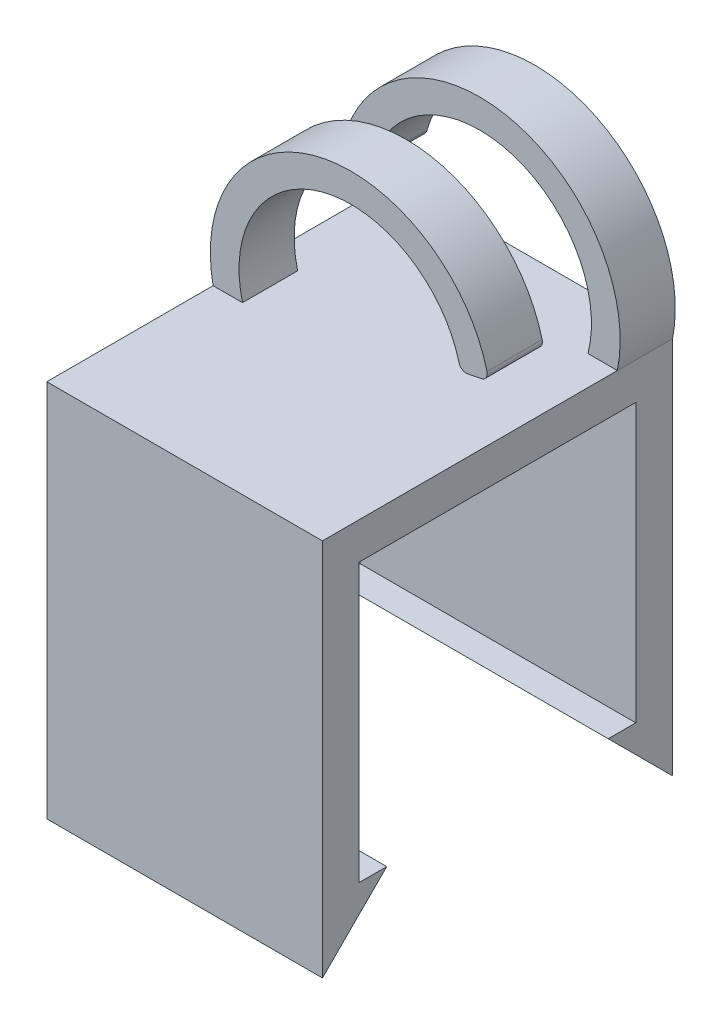
ISO-10303-21;
HEADER;
FILE_DESCRIPTION(('STEP AP214'),'2;1');
FILE_NAME('part.step','',(''),(''),'','','');
FILE_SCHEMA(('AUTOMOTIVE_DESIGN { 1 0 10303 214 1 1 1 1 }'));
ENDSEC;
DATA;
#1=APPLICATION_CONTEXT('core data for automotive mechanical design processes');
#2=APPLICATION_PROTOCOL_DEFINITION('international standard','automotive_design',2000,#1);
#3=PRODUCT_CONTEXT('',#1,'mechanical');
#4=PRODUCT('Part','Part','',(#3));
#5=PRODUCT_RELATED_PRODUCT_CATEGORY('part','',(#4));
#6=PRODUCT_DEFINITION_FORMATION('','',#4);
#7=PRODUCT_DEFINITION_CONTEXT('part definition',#1,'design');
#8=PRODUCT_DEFINITION('design','',#6,#7);
#9=PRODUCT_DEFINITION_SHAPE('','',#8);
#10=(LENGTH_UNIT() NAMED_UNIT(*) SI_UNIT(.MILLI.,.METRE.));
#11=(NAMED_UNIT(*) PLANE_ANGLE_UNIT() SI_UNIT($,.RADIAN.));
#12=(NAMED_UNIT(*) SI_UNIT($,.STERADIAN.) SOLID_ANGLE_UNIT());
#13=UNCERTAINTY_MEASURE_WITH_UNIT(LENGTH_MEASURE(1.E-05),#10,'distance_accuracy_value','');
#14=(GEOMETRIC_REPRESENTATION_CONTEXT(3) GLOBAL_UNCERTAINTY_ASSIGNED_CONTEXT((#13)) GLOBAL_UNIT_ASSIGNED_CONTEXT((#10,
#11,#12)) REPRESENTATION_CONTEXT('',''));
#15=CARTESIAN_POINT('',(0.,0.,0.));
#16=DIRECTION('',(0.,0.,1.));
#17=DIRECTION('',(1.,0.,0.));
#18=AXIS2_PLACEMENT_3D('',#15,#16,#17);
#19=CARTESIAN_POINT('',(0.,17.1,0.));
#20=DIRECTION('',(0.,1.,0.));
#21=DIRECTION('',(0.,0.,1.));
#22=AXIS2_PLACEMENT_3D('',#19,#20,#21);
#23=PLANE('',#22);
#24=DIRECTION('',(0.,0.,-1.));
#25=VECTOR('',#24,1.);
#26=CARTESIAN_POINT('',(-14.0296296296296,17.1,3.13518518518521));
#27=LINE('',#26,#25);
#28=CARTESIAN_POINT('',(-14.0296296296296,17.1,3.13518518518521));
#29=VERTEX_POINT('',#28);
#30=CARTESIAN_POINT('',(-14.0296296296296,17.1,0.135185185185208));
#31=VERTEX_POINT('',#30);
#32=EDGE_CURVE('E52',#29,#31,#27,.T.);
#33=ORIENTED_EDGE('',*,*,#32,.F.);
#34=DIRECTION('',(1.,0.,0.));
#35=VECTOR('',#34,1.);
#36=CARTESIAN_POINT('',(-15.6296296296296,17.1,3.13518518518521));
#37=LINE('',#36,#35);
#38=CARTESIAN_POINT('',(-15.6296296296296,17.1,3.1351851851852));
#39=VERTEX_POINT('',#38);
#40=EDGE_CURVE('E187',#39,#29,#37,.T.);
#41=ORIENTED_EDGE('',*,*,#40,.F.);
#42=DIRECTION('',(0.,0.,1.));
#43=VECTOR('',#42,1.);
#44=CARTESIAN_POINT('',(-15.6296296296296,17.1,-6.86481481481479));
#45=LINE('',#44,#43);
#46=CARTESIAN_POINT('',(-15.6296296296296,17.1,12.1851851851852));
#47=VERTEX_POINT('',#46);
#48=EDGE_CURVE('E324',#39,#47,#45,.T.);
#49=ORIENTED_EDGE('',*,*,#48,.T.);
#50=DIRECTION('',(1.,0.,0.));
#51=VECTOR('',#50,1.);
#52=CARTESIAN_POINT('',(-15.6296296296296,17.1,12.1851851851852));
#53=LINE('',#52,#51);
#54=CARTESIAN_POINT('',(-0.629629629629607,17.1,12.1851851851852));
#55=VERTEX_POINT('',#54);
#56=EDGE_CURVE('E323',#47,#55,#53,.T.);
#57=ORIENTED_EDGE('',*,*,#56,.T.);
#58=DIRECTION('',(0.,0.,-1.));
#59=VECTOR('',#58,1.);
#60=CARTESIAN_POINT('',(-0.629629629629609,17.1,-6.86481481481479));
#61=LINE('',#60,#59);
#62=CARTESIAN_POINT('',(-0.629629629629609,17.1,-3.86481481481479));
#63=VERTEX_POINT('',#62);
#64=EDGE_CURVE('E326',#55,#63,#61,.T.);
#65=ORIENTED_EDGE('',*,*,#64,.T.);
#66=DIRECTION('',(-1.,0.,0.));
#67=VECTOR('',#66,1.);
#68=CARTESIAN_POINT('',(-2.22962962962961,17.1,-3.86481481481479));
#69=LINE('',#68,#67);
#70=CARTESIAN_POINT('',(-2.22962962962961,17.1,-3.86481481481479));
#71=VERTEX_POINT('',#70);
#72=EDGE_CURVE('E236',#63,#71,#69,.T.);
#73=ORIENTED_EDGE('',*,*,#72,.T.);
#74=DIRECTION('',(0.,0.,-1.));
#75=VECTOR('',#74,1.);
#76=CARTESIAN_POINT('',(-2.22962962962961,17.1,-3.86481481481479));
#77=LINE('',#76,#75);
#78=CARTESIAN_POINT('',(-2.22962962962961,17.1,-6.86481481481479));
#79=VERTEX_POINT('',#78);
#80=EDGE_CURVE('E274',#71,#79,#77,.T.);
#81=ORIENTED_EDGE('',*,*,#80,.T.);
#82=DIRECTION('',(-1.,0.,0.));
#83=VECTOR('',#82,1.);
#84=CARTESIAN_POINT('',(-15.6296296296296,17.1,-6.86481481481479));
#85=LINE('',#84,#83);
#86=CARTESIAN_POINT('',(-15.6296296296296,17.1,-6.86481481481479));
#87=VERTEX_POINT('',#86);
#88=EDGE_CURVE('E329',#79,#87,#85,.T.);
#89=ORIENTED_EDGE('',*,*,#88,.T.);
#90=CARTESIAN_POINT('',(-15.6296296296296,17.1,0.135185185185208));
#91=VERTEX_POINT('',#90);
#92=EDGE_CURVE('E321',#87,#91,#45,.T.);
#93=ORIENTED_EDGE('',*,*,#92,.T.);
#94=DIRECTION('',(1.,0.,0.));
#95=VECTOR('',#94,1.);
#96=CARTESIAN_POINT('',(-15.6296296296296,17.1,0.135185185185208));
#97=LINE('',#96,#95);
#98=EDGE_CURVE('E57',#91,#31,#97,.T.);
#99=ORIENTED_EDGE('',*,*,#98,.T.);
#100=EDGE_LOOP('',(#33,#41,#49,#57,#65,#73,#81,#89,#93,#99));
#101=FACE_BOUND('',#100,.T.);
#102=ADVANCED_FACE('F37',(#101),#23,.T.);
#103=CARTESIAN_POINT('',(-15.6296296296296,15.1,0.));
#104=DIRECTION('',(1.,0.,0.));
#105=DIRECTION('',(0.,0.,-1.));
#106=AXIS2_PLACEMENT_3D('',#103,#104,#105);
#107=PLANE('',#106);
#108=DIRECTION('',(0.,-1.,0.));
#109=VECTOR('',#108,1.);
#110=CARTESIAN_POINT('',(-15.6296296296296,15.1,-6.86481481481479));
#111=LINE('',#110,#109);
#112=CARTESIAN_POINT('',(-15.6296296296296,-3.5,-6.86481481481479));
#113=VERTEX_POINT('',#112);
#114=EDGE_CURVE('E343',#87,#113,#111,.T.);
#115=ORIENTED_EDGE('',*,*,#114,.T.);
#116=DIRECTION('',(0.,0.707106781186547,0.707106781186547));
#117=VECTOR('',#116,1.);
#118=CARTESIAN_POINT('',(-15.6296296296296,0.,-3.36481481481479));
#119=LINE('',#118,#117);
#120=CARTESIAN_POINT('',(-15.6296296296296,0.,-3.36481481481479));
#121=VERTEX_POINT('',#120);
#122=EDGE_CURVE('E292',#113,#121,#119,.T.);
#123=ORIENTED_EDGE('',*,*,#122,.T.);
#124=DIRECTION('',(0.,0.,-1.));
#125=VECTOR('',#124,1.);
#126=CARTESIAN_POINT('',(-15.6296296296296,0.,-6.86481481481479));
#127=LINE('',#126,#125);
#128=CARTESIAN_POINT('',(-15.6296296296296,0.,-4.86481481481479));
#129=VERTEX_POINT('',#128);
#130=EDGE_CURVE('E299',#121,#129,#127,.T.);
#131=ORIENTED_EDGE('',*,*,#130,.T.);
#132=DIRECTION('',(0.,-1.,0.));
#133=VECTOR('',#132,1.);
#134=CARTESIAN_POINT('',(-15.6296296296296,15.1,-4.86481481481479));
#135=LINE('',#134,#133);
#136=CARTESIAN_POINT('',(-15.6296296296296,15.1,-4.86481481481479));
#137=VERTEX_POINT('',#136);
#138=EDGE_CURVE('E11',#137,#129,#135,.T.);
#139=ORIENTED_EDGE('',*,*,#138,.F.);
#140=DIRECTION('',(0.,0.,1.));
#141=VECTOR('',#140,1.);
#142=CARTESIAN_POINT('',(-15.6296296296296,15.1,-6.86481481481479));
#143=LINE('',#142,#141);
#144=CARTESIAN_POINT('',(-15.6296296296296,15.1,10.1851851851852));
#145=VERTEX_POINT('',#144);
#146=EDGE_CURVE('E320',#137,#145,#143,.T.);
#147=ORIENTED_EDGE('',*,*,#146,.T.);
#148=DIRECTION('',(0.,-1.,0.));
#149=VECTOR('',#148,1.);
#150=CARTESIAN_POINT('',(-15.6296296296296,15.1,10.1851851851852));
#151=LINE('',#150,#149);
#152=CARTESIAN_POINT('',(-15.6296296296296,0.,10.1851851851852));
#153=VERTEX_POINT('',#152);
#154=EDGE_CURVE('E317',#145,#153,#151,.T.);
#155=ORIENTED_EDGE('',*,*,#154,.T.);
#156=DIRECTION('',(0.,0.,-1.));
#157=VECTOR('',#156,1.);
#158=CARTESIAN_POINT('',(-15.6296296296296,0.,12.1851851851852));
#159=LINE('',#158,#157);
#160=CARTESIAN_POINT('',(-15.6296296296296,0.,8.68518518518521));
#161=VERTEX_POINT('',#160);
#162=EDGE_CURVE('E267',#153,#161,#159,.T.);
#163=ORIENTED_EDGE('',*,*,#162,.T.);
#164=DIRECTION('',(0.,-0.707106781186547,0.707106781186547));
#165=VECTOR('',#164,1.);
#166=CARTESIAN_POINT('',(-15.6296296296296,0.,8.68518518518521));
#167=LINE('',#166,#165);
#168=CARTESIAN_POINT('',(-15.6296296296296,-3.5,12.1851851851852));
#169=VERTEX_POINT('',#168);
#170=EDGE_CURVE('E282',#161,#169,#167,.T.);
#171=ORIENTED_EDGE('',*,*,#170,.T.);
#172=DIRECTION('',(0.,-1.,0.));
#173=VECTOR('',#172,1.);
#174=CARTESIAN_POINT('',(-15.6296296296296,17.1,12.1851851851852));
#175=LINE('',#174,#173);
#176=EDGE_CURVE('E337',#47,#169,#175,.T.);
#177=ORIENTED_EDGE('',*,*,#176,.F.);
#178=ORIENTED_EDGE('',*,*,#48,.F.);
#179=DIRECTION('',(0.,0.,-1.));
#180=VECTOR('',#179,1.);
#181=CARTESIAN_POINT('',(-15.6296296296296,17.1,3.13518518518521));
#182=LINE('',#181,#180);
#183=EDGE_CURVE('E229',#39,#91,#182,.T.);
#184=ORIENTED_EDGE('',*,*,#183,.T.);
#185=ORIENTED_EDGE('',*,*,#92,.F.);
#186=EDGE_LOOP('',(#115,#123,#131,#139,#147,#155,#163,#171,#177,#178,#184,#185));
#187=FACE_BOUND('',#186,.T.);
#188=ADVANCED_FACE('F39',(#187),#107,.F.);
#189=CARTESIAN_POINT('',(0.,15.1,-4.86481481481479));
#190=DIRECTION('',(0.,0.,-1.));
#191=DIRECTION('',(-1.,0.,0.));
#192=AXIS2_PLACEMENT_3D('',#189,#190,#191);
#193=PLANE('',#192);
#194=DIRECTION('',(1.,0.,0.));
#195=VECTOR('',#194,1.);
#196=CARTESIAN_POINT('',(0.,0.,-4.86481481481479));
#197=LINE('',#196,#195);
#198=CARTESIAN_POINT('',(-0.629629629629615,0.,-4.86481481481479));
#199=VERTEX_POINT('',#198);
#200=EDGE_CURVE('E339',#129,#199,#197,.T.);
#201=ORIENTED_EDGE('',*,*,#200,.T.);
#202=DIRECTION('',(0.,-1.,0.));
#203=VECTOR('',#202,1.);
#204=CARTESIAN_POINT('',(-0.629629629629614,15.1,-4.86481481481479));
#205=LINE('',#204,#203);
#206=CARTESIAN_POINT('',(-0.629629629629609,15.1,-4.86481481481479));
#207=VERTEX_POINT('',#206);
#208=EDGE_CURVE('E45',#207,#199,#205,.T.);
#209=ORIENTED_EDGE('',*,*,#208,.F.);
#210=DIRECTION('',(1.,0.,0.));
#211=VECTOR('',#210,1.);
#212=CARTESIAN_POINT('',(0.,15.1,-4.86481481481479));
#213=LINE('',#212,#211);
#214=EDGE_CURVE('E340',#137,#207,#213,.T.);
#215=ORIENTED_EDGE('',*,*,#214,.F.);
#216=ORIENTED_EDGE('',*,*,#138,.T.);
#217=EDGE_LOOP('',(#201,#209,#215,#216));
#218=FACE_BOUND('',#217,.T.);
#219=ADVANCED_FACE('F357',(#218),#193,.F.);
#220=CARTESIAN_POINT('',(-0.629629629629612,15.1,0.));
#221=DIRECTION('',(1.,0.,0.));
#222=DIRECTION('',(0.,0.,-1.));
#223=AXIS2_PLACEMENT_3D('',#220,#221,#222);
#224=PLANE('',#223);
#225=ORIENTED_EDGE('',*,*,#208,.T.);
#226=DIRECTION('',(0.,0.,-1.));
#227=VECTOR('',#226,1.);
#228=CARTESIAN_POINT('',(-0.629629629629615,0.,-6.86481481481479));
#229=LINE('',#228,#227);
#230=CARTESIAN_POINT('',(-0.629629629629615,0.,-3.36481481481479));
#231=VERTEX_POINT('',#230);
#232=EDGE_CURVE('E298',#231,#199,#229,.T.);
#233=ORIENTED_EDGE('',*,*,#232,.F.);
#234=DIRECTION('',(0.,0.707106781186547,0.707106781186547));
#235=VECTOR('',#234,1.);
#236=CARTESIAN_POINT('',(-0.629629629629615,0.,-3.36481481481479));
#237=LINE('',#236,#235);
#238=CARTESIAN_POINT('',(-0.629629629629615,-3.5,-6.86481481481479));
#239=VERTEX_POINT('',#238);
#240=EDGE_CURVE('E295',#239,#231,#237,.T.);
#241=ORIENTED_EDGE('',*,*,#240,.F.);
#242=DIRECTION('',(0.,-1.,0.));
#243=VECTOR('',#242,1.);
#244=CARTESIAN_POINT('',(-0.629629629629615,15.1,-6.86481481481479));
#245=LINE('',#244,#243);
#246=CARTESIAN_POINT('',(-0.629629629629609,17.1,-6.86481481481479));
#247=VERTEX_POINT('',#246);
#248=EDGE_CURVE('E347',#247,#239,#245,.T.);
#249=ORIENTED_EDGE('',*,*,#248,.F.);
#250=DIRECTION('',(0.,0.,-1.));
#251=VECTOR('',#250,1.);
#252=CARTESIAN_POINT('',(-0.629629629629609,17.1,-3.86481481481479));
#253=LINE('',#252,#251);
#254=EDGE_CURVE('E251',#63,#247,#253,.T.);
#255=ORIENTED_EDGE('',*,*,#254,.F.);
#256=ORIENTED_EDGE('',*,*,#64,.F.);
#257=DIRECTION('',(0.,-1.,0.));
#258=VECTOR('',#257,1.);
#259=CARTESIAN_POINT('',(-0.629629629629607,17.1,12.1851851851852));
#260=LINE('',#259,#258);
#261=CARTESIAN_POINT('',(-0.629629629629615,-3.5,12.1851851851852));
#262=VERTEX_POINT('',#261);
#263=EDGE_CURVE('E331',#55,#262,#260,.T.);
#264=ORIENTED_EDGE('',*,*,#263,.T.);
#265=DIRECTION('',(0.,-0.707106781186547,0.707106781186547));
#266=VECTOR('',#265,1.);
#267=CARTESIAN_POINT('',(-0.629629629629615,0.,8.68518518518521));
#268=LINE('',#267,#266);
#269=CARTESIAN_POINT('',(-0.629629629629615,0.,8.68518518518521));
#270=VERTEX_POINT('',#269);
#271=EDGE_CURVE('E281',#270,#262,#268,.T.);
#272=ORIENTED_EDGE('',*,*,#271,.F.);
#273=DIRECTION('',(0.,0.,-1.));
#274=VECTOR('',#273,1.);
#275=CARTESIAN_POINT('',(-0.629629629629615,0.,12.1851851851852));
#276=LINE('',#275,#274);
#277=CARTESIAN_POINT('',(-0.629629629629615,0.,10.1851851851852));
#278=VERTEX_POINT('',#277);
#279=EDGE_CURVE('E279',#278,#270,#276,.T.);
#280=ORIENTED_EDGE('',*,*,#279,.F.);
#281=DIRECTION('',(0.,-1.,0.));
#282=VECTOR('',#281,1.);
#283=CARTESIAN_POINT('',(-0.629629629629608,15.1,10.1851851851852));
#284=LINE('',#283,#282);
#285=CARTESIAN_POINT('',(-0.629629629629608,15.1,10.1851851851852));
#286=VERTEX_POINT('',#285);
#287=EDGE_CURVE('E313',#286,#278,#284,.T.);
#288=ORIENTED_EDGE('',*,*,#287,.F.);
#289=DIRECTION('',(0.,0.,-1.));
#290=VECTOR('',#289,1.);
#291=CARTESIAN_POINT('',(-0.629629629629609,15.1,-6.86481481481479));
#292=LINE('',#291,#290);
#293=EDGE_CURVE('E334',#286,#207,#292,.T.);
#294=ORIENTED_EDGE('',*,*,#293,.T.);
#295=EDGE_LOOP('',(#225,#233,#241,#249,#255,#256,#264,#272,#280,#288,#294));
#296=FACE_BOUND('',#295,.T.);
#297=ADVANCED_FACE('F352',(#296),#224,.T.);
#298=CARTESIAN_POINT('',(0.,15.1,-6.86481481481479));
#299=DIRECTION('',(0.,0.,-1.));
#300=DIRECTION('',(-1.,0.,0.));
#301=AXIS2_PLACEMENT_3D('',#298,#299,#300);
#302=PLANE('',#301);
#303=ORIENTED_EDGE('',*,*,#248,.T.);
#304=DIRECTION('',(-1.,0.,0.));
#305=VECTOR('',#304,1.);
#306=CARTESIAN_POINT('',(-0.629629629629615,-3.5,-6.86481481481479));
#307=LINE('',#306,#305);
#308=EDGE_CURVE('E301',#239,#113,#307,.T.);
#309=ORIENTED_EDGE('',*,*,#308,.T.);
#310=ORIENTED_EDGE('',*,*,#114,.F.);
#311=ORIENTED_EDGE('',*,*,#88,.F.);
#312=CARTESIAN_POINT('',(-8.12962962962961,18.6,-6.86481481481479));
#313=DIRECTION('',(0.,0.,1.));
#314=DIRECTION('',(1.,0.,0.));
#315=AXIS2_PLACEMENT_3D('',#312,#313,#314);
#316=CIRCLE('',#315,6.08769250208977);
#317=CARTESIAN_POINT('',(-13.9912687766734,20.2435286763071,-6.86481481481479));
#318=VERTEX_POINT('',#317);
#319=EDGE_CURVE('E254',#79,#318,#316,.T.);
#320=ORIENTED_EDGE('',*,*,#319,.T.);
#321=CARTESIAN_POINT('',(-14.4727023531091,20.3785164960552,-6.86481481481479));
#322=DIRECTION('',(0.,0.,-1.));
#323=DIRECTION('',(-1.,0.,0.));
#324=AXIS2_PLACEMENT_3D('',#321,#322,#323);
#325=CIRCLE('',#324,0.499999999999997);
#326=CARTESIAN_POINT('',(-14.5707604206782,19.8882261582097,-6.86481481481479));
#327=VERTEX_POINT('',#326);
#328=EDGE_CURVE('E257',#318,#327,#325,.T.);
#329=ORIENTED_EDGE('',*,*,#328,.T.);
#330=DIRECTION('',(-0.980580675690921,0.196116135138179,0.));
#331=VECTOR('',#330,1.);
#332=CARTESIAN_POINT('',(-14.5707604206782,19.8882261582097,-6.86481481481479));
#333=LINE('',#332,#331);
#334=CARTESIAN_POINT('',(-15.1221717233405,19.9985084187422,-6.86481481481479));
#335=VERTEX_POINT('',#334);
#336=EDGE_CURVE('E260',#327,#335,#333,.T.);
#337=ORIENTED_EDGE('',*,*,#336,.T.);
#338=CARTESIAN_POINT('',(-15.0241136557714,20.4887987565876,-6.86481481481479));
#339=DIRECTION('',(0.,0.,-1.));
#340=DIRECTION('',(1.,0.,0.));
#341=AXIS2_PLACEMENT_3D('',#338,#339,#340);
#342=CIRCLE('',#341,0.499999999999997);
#343=CARTESIAN_POINT('',(-15.5063445990439,20.620909760484,-6.86481481481479));
#344=VERTEX_POINT('',#343);
#345=EDGE_CURVE('E237',#335,#344,#342,.T.);
#346=ORIENTED_EDGE('',*,*,#345,.T.);
#347=CARTESIAN_POINT('',(-8.12962962962961,18.6,-6.86481481481479));
#348=DIRECTION('',(0.,0.,-1.));
#349=DIRECTION('',(1.,0.,0.));
#350=AXIS2_PLACEMENT_3D('',#347,#348,#349);
#351=CIRCLE('',#350,7.64852927038918);
#352=EDGE_CURVE('E232',#344,#247,#351,.T.);
#353=ORIENTED_EDGE('',*,*,#352,.T.);
#354=EDGE_LOOP('',(#303,#309,#310,#311,#320,#329,#337,#346,#353));
#355=FACE_BOUND('',#354,.T.);
#356=ADVANCED_FACE('F372',(#355),#302,.T.);
#357=CARTESIAN_POINT('',(0.,15.1,0.));
#358=DIRECTION('',(0.,1.,0.));
#359=DIRECTION('',(0.,0.,1.));
#360=AXIS2_PLACEMENT_3D('',#357,#358,#359);
#361=PLANE('',#360);
#362=ORIENTED_EDGE('',*,*,#293,.F.);
#363=DIRECTION('',(1.,0.,0.));
#364=VECTOR('',#363,1.);
#365=CARTESIAN_POINT('',(0.,15.1,10.1851851851852));
#366=LINE('',#365,#364);
#367=EDGE_CURVE('E310',#145,#286,#366,.T.);
#368=ORIENTED_EDGE('',*,*,#367,.F.);
#369=ORIENTED_EDGE('',*,*,#146,.F.);
#370=ORIENTED_EDGE('',*,*,#214,.T.);
#371=EDGE_LOOP('',(#362,#368,#369,#370));
#372=FACE_BOUND('',#371,.T.);
#373=ADVANCED_FACE('F428',(#372),#361,.F.);
#374=CARTESIAN_POINT('',(-15.6296296296296,17.1,12.1851851851852));
#375=DIRECTION('',(0.,0.,-1.));
#376=DIRECTION('',(-1.,0.,0.));
#377=AXIS2_PLACEMENT_3D('',#374,#375,#376);
#378=PLANE('',#377);
#379=ORIENTED_EDGE('',*,*,#176,.T.);
#380=DIRECTION('',(-1.,0.,0.));
#381=VECTOR('',#380,1.);
#382=CARTESIAN_POINT('',(-0.629629629629615,-3.5,12.1851851851852));
#383=LINE('',#382,#381);
#384=EDGE_CURVE('E289',#262,#169,#383,.T.);
#385=ORIENTED_EDGE('',*,*,#384,.F.);
#386=ORIENTED_EDGE('',*,*,#263,.F.);
#387=ORIENTED_EDGE('',*,*,#56,.F.);
#388=EDGE_LOOP('',(#379,#385,#386,#387));
#389=FACE_BOUND('',#388,.T.);
#390=ADVANCED_FACE('F431',(#389),#378,.F.);
#391=CARTESIAN_POINT('',(0.,15.1,10.1851851851852));
#392=DIRECTION('',(0.,0.,-1.));
#393=DIRECTION('',(-1.,0.,0.));
#394=AXIS2_PLACEMENT_3D('',#391,#392,#393);
#395=PLANE('',#394);
#396=DIRECTION('',(1.,0.,0.));
#397=VECTOR('',#396,1.);
#398=CARTESIAN_POINT('',(0.,0.,10.1851851851852));
#399=LINE('',#398,#397);
#400=EDGE_CURVE('E307',#153,#278,#399,.T.);
#401=ORIENTED_EDGE('',*,*,#400,.F.);
#402=ORIENTED_EDGE('',*,*,#154,.F.);
#403=ORIENTED_EDGE('',*,*,#367,.T.);
#404=ORIENTED_EDGE('',*,*,#287,.T.);
#405=EDGE_LOOP('',(#401,#402,#403,#404));
#406=FACE_BOUND('',#405,.T.);
#407=ADVANCED_FACE('F426',(#406),#395,.T.);
#408=CARTESIAN_POINT('',(-0.629629629629615,0.,-6.86481481481479));
#409=DIRECTION('',(0.,1.,0.));
#410=DIRECTION('',(0.,0.,1.));
#411=AXIS2_PLACEMENT_3D('',#408,#409,#410);
#412=PLANE('',#411);
#413=ORIENTED_EDGE('',*,*,#200,.F.);
#414=ORIENTED_EDGE('',*,*,#130,.F.);
#415=DIRECTION('',(-1.,0.,0.));
#416=VECTOR('',#415,1.);
#417=CARTESIAN_POINT('',(-0.629629629629615,0.,-3.36481481481479));
#418=LINE('',#417,#416);
#419=EDGE_CURVE('E305',#231,#121,#418,.T.);
#420=ORIENTED_EDGE('',*,*,#419,.F.);
#421=ORIENTED_EDGE('',*,*,#232,.T.);
#422=EDGE_LOOP('',(#413,#414,#420,#421));
#423=FACE_BOUND('',#422,.T.);
#424=ADVANCED_FACE('F361',(#423),#412,.T.);
#425=CARTESIAN_POINT('',(-0.629629629629615,0.,-3.36481481481479));
#426=DIRECTION('',(0.,-0.707106781186548,0.707106781186548));
#427=DIRECTION('',(0.,-0.707106781186548,-0.707106781186548));
#428=AXIS2_PLACEMENT_3D('',#425,#426,#427);
#429=PLANE('',#428);
#430=ORIENTED_EDGE('',*,*,#122,.F.);
#431=ORIENTED_EDGE('',*,*,#308,.F.);
#432=ORIENTED_EDGE('',*,*,#240,.T.);
#433=ORIENTED_EDGE('',*,*,#419,.T.);
#434=EDGE_LOOP('',(#430,#431,#432,#433));
#435=FACE_BOUND('',#434,.T.);
#436=ADVANCED_FACE('F365',(#435),#429,.T.);
#437=CARTESIAN_POINT('',(-0.629629629629615,0.,8.68518518518521));
#438=DIRECTION('',(0.,-0.707106781186547,-0.707106781186547));
#439=DIRECTION('',(0.,0.707106781186548,-0.707106781186548));
#440=AXIS2_PLACEMENT_3D('',#437,#438,#439);
#441=PLANE('',#440);
#442=ORIENTED_EDGE('',*,*,#170,.F.);
#443=DIRECTION('',(-1.,0.,0.));
#444=VECTOR('',#443,1.);
#445=CARTESIAN_POINT('',(-0.629629629629615,0.,8.68518518518521));
#446=LINE('',#445,#444);
#447=EDGE_CURVE('E285',#270,#161,#446,.T.);
#448=ORIENTED_EDGE('',*,*,#447,.F.);
#449=ORIENTED_EDGE('',*,*,#271,.T.);
#450=ORIENTED_EDGE('',*,*,#384,.T.);
#451=EDGE_LOOP('',(#442,#448,#449,#450));
#452=FACE_BOUND('',#451,.T.);
#453=ADVANCED_FACE('F480',(#452),#441,.T.);
#454=CARTESIAN_POINT('',(-0.629629629629615,0.,12.1851851851852));
#455=DIRECTION('',(0.,1.,0.));
#456=DIRECTION('',(0.,0.,1.));
#457=AXIS2_PLACEMENT_3D('',#454,#455,#456);
#458=PLANE('',#457);
#459=ORIENTED_EDGE('',*,*,#162,.F.);
#460=ORIENTED_EDGE('',*,*,#400,.T.);
#461=ORIENTED_EDGE('',*,*,#279,.T.);
#462=ORIENTED_EDGE('',*,*,#447,.T.);
#463=EDGE_LOOP('',(#459,#460,#461,#462));
#464=FACE_BOUND('',#463,.T.);
#465=ADVANCED_FACE('F486',(#464),#458,.T.);
#466=CARTESIAN_POINT('',(-8.12962962962961,18.6,-3.86481481481479));
#467=DIRECTION('',(0.,0.,-1.));
#468=DIRECTION('',(-1.,0.,0.));
#469=AXIS2_PLACEMENT_3D('',#466,#467,#468);
#470=CYLINDRICAL_SURFACE('',#469,7.64852927038918);
#471=ORIENTED_EDGE('',*,*,#352,.F.);
#472=DIRECTION('',(0.,0.,-1.));
#473=VECTOR('',#472,1.);
#474=CARTESIAN_POINT('',(-15.5063445990439,20.620909760484,-3.86481481481479));
#475=LINE('',#474,#473);
#476=CARTESIAN_POINT('',(-15.5063445990439,20.620909760484,-3.86481481481479));
#477=VERTEX_POINT('',#476);
#478=EDGE_CURVE('E265',#477,#344,#475,.T.);
#479=ORIENTED_EDGE('',*,*,#478,.F.);
#480=CARTESIAN_POINT('',(-8.12962962962961,18.6,-3.86481481481479));
#481=DIRECTION('',(0.,0.,-1.));
#482=DIRECTION('',(1.,0.,0.));
#483=AXIS2_PLACEMENT_3D('',#480,#481,#482);
#484=CIRCLE('',#483,7.64852927038918);
#485=EDGE_CURVE('E233',#477,#63,#484,.T.);
#486=ORIENTED_EDGE('',*,*,#485,.T.);
#487=ORIENTED_EDGE('',*,*,#254,.T.);
#488=EDGE_LOOP('',(#471,#479,#486,#487));
#489=FACE_BOUND('',#488,.T.);
#490=ADVANCED_FACE('F370',(#489),#470,.T.);
#491=CARTESIAN_POINT('',(-15.0241136557714,20.4887987565876,-3.86481481481479));
#492=DIRECTION('',(0.,0.,-1.));
#493=DIRECTION('',(-1.,0.,0.));
#494=AXIS2_PLACEMENT_3D('',#491,#492,#493);
#495=CYLINDRICAL_SURFACE('',#494,0.499999999999997);
#496=ORIENTED_EDGE('',*,*,#345,.F.);
#497=DIRECTION('',(0.,0.,-1.));
#498=VECTOR('',#497,1.);
#499=CARTESIAN_POINT('',(-15.1221717233405,19.9985084187422,-3.86481481481479));
#500=LINE('',#499,#498);
#501=CARTESIAN_POINT('',(-15.1221717233405,19.9985084187422,-3.86481481481479));
#502=VERTEX_POINT('',#501);
#503=EDGE_CURVE('E268',#502,#335,#500,.T.);
#504=ORIENTED_EDGE('',*,*,#503,.F.);
#505=CARTESIAN_POINT('',(-15.0241136557714,20.4887987565876,-3.86481481481479));
#506=DIRECTION('',(0.,0.,-1.));
#507=DIRECTION('',(1.,0.,0.));
#508=AXIS2_PLACEMENT_3D('',#505,#506,#507);
#509=CIRCLE('',#508,0.499999999999997);
#510=EDGE_CURVE('E248',#502,#477,#509,.T.);
#511=ORIENTED_EDGE('',*,*,#510,.T.);
#512=ORIENTED_EDGE('',*,*,#478,.T.);
#513=EDGE_LOOP('',(#496,#504,#511,#512));
#514=FACE_BOUND('',#513,.T.);
#515=ADVANCED_FACE('F376',(#514),#495,.T.);
#516=CARTESIAN_POINT('',(-14.5707604206782,19.8882261582097,-3.86481481481479));
#517=DIRECTION('',(-0.196116135138179,-0.980580675690921,0.));
#518=DIRECTION('',(0.980580675690921,-0.196116135138179,0.));
#519=AXIS2_PLACEMENT_3D('',#516,#517,#518);
#520=PLANE('',#519);
#521=ORIENTED_EDGE('',*,*,#336,.F.);
#522=DIRECTION('',(0.,0.,-1.));
#523=VECTOR('',#522,1.);
#524=CARTESIAN_POINT('',(-14.5707604206782,19.8882261582097,-3.86481481481479));
#525=LINE('',#524,#523);
#526=CARTESIAN_POINT('',(-14.5707604206782,19.8882261582097,-3.86481481481479));
#527=VERTEX_POINT('',#526);
#528=EDGE_CURVE('E270',#527,#327,#525,.T.);
#529=ORIENTED_EDGE('',*,*,#528,.F.);
#530=DIRECTION('',(-0.980580675690921,0.196116135138179,0.));
#531=VECTOR('',#530,1.);
#532=CARTESIAN_POINT('',(-14.5707604206782,19.8882261582097,-3.86481481481479));
#533=LINE('',#532,#531);
#534=EDGE_CURVE('E245',#527,#502,#533,.T.);
#535=ORIENTED_EDGE('',*,*,#534,.T.);
#536=ORIENTED_EDGE('',*,*,#503,.T.);
#537=EDGE_LOOP('',(#521,#529,#535,#536));
#538=FACE_BOUND('',#537,.T.);
#539=ADVANCED_FACE('F505',(#538),#520,.T.);
#540=CARTESIAN_POINT('',(-14.4727023531091,20.3785164960552,-3.86481481481479));
#541=DIRECTION('',(0.,0.,-1.));
#542=DIRECTION('',(-1.,0.,0.));
#543=AXIS2_PLACEMENT_3D('',#540,#541,#542);
#544=CYLINDRICAL_SURFACE('',#543,0.499999999999997);
#545=ORIENTED_EDGE('',*,*,#328,.F.);
#546=DIRECTION('',(0.,0.,-1.));
#547=VECTOR('',#546,1.);
#548=CARTESIAN_POINT('',(-13.9912687766734,20.2435286763071,-3.86481481481479));
#549=LINE('',#548,#547);
#550=CARTESIAN_POINT('',(-13.9912687766734,20.2435286763071,-3.86481481481479));
#551=VERTEX_POINT('',#550);
#552=EDGE_CURVE('E272',#551,#318,#549,.T.);
#553=ORIENTED_EDGE('',*,*,#552,.F.);
#554=CARTESIAN_POINT('',(-14.4727023531091,20.3785164960552,-3.86481481481479));
#555=DIRECTION('',(0.,0.,-1.));
#556=DIRECTION('',(-1.,0.,0.));
#557=AXIS2_PLACEMENT_3D('',#554,#555,#556);
#558=CIRCLE('',#557,0.499999999999997);
#559=EDGE_CURVE('E242',#551,#527,#558,.T.);
#560=ORIENTED_EDGE('',*,*,#559,.T.);
#561=ORIENTED_EDGE('',*,*,#528,.T.);
#562=EDGE_LOOP('',(#545,#553,#560,#561));
#563=FACE_BOUND('',#562,.T.);
#564=ADVANCED_FACE('F512',(#563),#544,.T.);
#565=CARTESIAN_POINT('',(-8.12962962962961,18.6,-3.86481481481479));
#566=DIRECTION('',(0.,0.,-1.));
#567=DIRECTION('',(-1.,0.,0.));
#568=AXIS2_PLACEMENT_3D('',#565,#566,#567);
#569=CYLINDRICAL_SURFACE('',#568,6.08769250208977);
#570=ORIENTED_EDGE('',*,*,#319,.F.);
#571=ORIENTED_EDGE('',*,*,#80,.F.);
#572=CARTESIAN_POINT('',(-8.12962962962961,18.6,-3.86481481481479));
#573=DIRECTION('',(0.,0.,1.));
#574=DIRECTION('',(1.,0.,0.));
#575=AXIS2_PLACEMENT_3D('',#572,#573,#574);
#576=CIRCLE('',#575,6.08769250208977);
#577=EDGE_CURVE('E239',#71,#551,#576,.T.);
#578=ORIENTED_EDGE('',*,*,#577,.T.);
#579=ORIENTED_EDGE('',*,*,#552,.T.);
#580=EDGE_LOOP('',(#570,#571,#578,#579));
#581=FACE_BOUND('',#580,.T.);
#582=ADVANCED_FACE('F387',(#581),#569,.F.);
#583=CARTESIAN_POINT('',(-8.12962962962961,18.6,-3.86481481481479));
#584=DIRECTION('',(0.,0.,1.));
#585=DIRECTION('',(1.,0.,0.));
#586=AXIS2_PLACEMENT_3D('',#583,#584,#585);
#587=PLANE('',#586);
#588=ORIENTED_EDGE('',*,*,#485,.F.);
#589=ORIENTED_EDGE('',*,*,#510,.F.);
#590=ORIENTED_EDGE('',*,*,#534,.F.);
#591=ORIENTED_EDGE('',*,*,#559,.F.);
#592=ORIENTED_EDGE('',*,*,#577,.F.);
#593=ORIENTED_EDGE('',*,*,#72,.F.);
#594=EDGE_LOOP('',(#588,#589,#590,#591,#592,#593));
#595=FACE_BOUND('',#594,.T.);
#596=ADVANCED_FACE('F380',(#595),#587,.T.);
#597=CARTESIAN_POINT('',(-8.12962962962961,18.6,3.13518518518521));
#598=DIRECTION('',(0.,0.,-1.));
#599=DIRECTION('',(-1.,0.,0.));
#600=AXIS2_PLACEMENT_3D('',#597,#598,#599);
#601=CYLINDRICAL_SURFACE('',#600,7.64852927038918);
#602=CARTESIAN_POINT('',(-8.12962962962961,18.6,0.135185185185208));
#603=DIRECTION('',(0.,0.,1.));
#604=DIRECTION('',(-1.,0.,0.));
#605=AXIS2_PLACEMENT_3D('',#602,#603,#604);
#606=CIRCLE('',#605,7.64852927038918);
#607=CARTESIAN_POINT('',(-0.723833364024043,20.5115913978522,0.135185185185208));
#608=VERTEX_POINT('',#607);
#609=EDGE_CURVE('E210',#608,#91,#606,.T.);
#610=ORIENTED_EDGE('',*,*,#609,.T.);
#611=ORIENTED_EDGE('',*,*,#183,.F.);
#612=CARTESIAN_POINT('',(-8.12962962962961,18.6,3.13518518518521));
#613=DIRECTION('',(0.,0.,1.));
#614=DIRECTION('',(-1.,0.,0.));
#615=AXIS2_PLACEMENT_3D('',#612,#613,#614);
#616=CIRCLE('',#615,7.64852927038918);
#617=CARTESIAN_POINT('',(-0.723833364024043,20.5115913978522,3.13518518518521));
#618=VERTEX_POINT('',#617);
#619=EDGE_CURVE('E221',#618,#39,#616,.T.);
#620=ORIENTED_EDGE('',*,*,#619,.F.);
#621=DIRECTION('',(0.,0.,-1.));
#622=VECTOR('',#621,1.);
#623=CARTESIAN_POINT('',(-0.723833364024043,20.5115913978522,3.13518518518521));
#624=LINE('',#623,#622);
#625=EDGE_CURVE('E209',#618,#608,#624,.T.);
#626=ORIENTED_EDGE('',*,*,#625,.T.);
#627=EDGE_LOOP('',(#610,#611,#620,#626));
#628=FACE_BOUND('',#627,.T.);
#629=ADVANCED_FACE('F401',(#628),#601,.T.);
#630=CARTESIAN_POINT('',(-8.12962962962961,18.6,3.13518518518521));
#631=DIRECTION('',(0.,0.,-1.));
#632=DIRECTION('',(-1.,0.,0.));
#633=AXIS2_PLACEMENT_3D('',#630,#631,#632);
#634=CYLINDRICAL_SURFACE('',#633,6.08769250208977);
#635=CARTESIAN_POINT('',(-8.12962962962961,18.6,0.135185185185208));
#636=DIRECTION('',(0.,0.,-1.));
#637=DIRECTION('',(-1.,0.,0.));
#638=AXIS2_PLACEMENT_3D('',#635,#636,#637);
#639=CIRCLE('',#638,6.08769250208977);
#640=CARTESIAN_POINT('',(-2.24512269904006,20.1596724604363,0.135185185185208));
#641=VERTEX_POINT('',#640);
#642=EDGE_CURVE('E194',#31,#641,#639,.T.);
#643=ORIENTED_EDGE('',*,*,#642,.T.);
#644=DIRECTION('',(0.,0.,-1.));
#645=VECTOR('',#644,1.);
#646=CARTESIAN_POINT('',(-2.24512269904006,20.1596724604363,3.13518518518521));
#647=LINE('',#646,#645);
#648=CARTESIAN_POINT('',(-2.24512269904006,20.1596724604363,3.13518518518521));
#649=VERTEX_POINT('',#648);
#650=EDGE_CURVE('E191',#649,#641,#647,.T.);
#651=ORIENTED_EDGE('',*,*,#650,.F.);
#652=CARTESIAN_POINT('',(-8.12962962962961,18.6,3.13518518518521));
#653=DIRECTION('',(0.,0.,-1.));
#654=DIRECTION('',(-1.,0.,0.));
#655=AXIS2_PLACEMENT_3D('',#652,#653,#654);
#656=CIRCLE('',#655,6.08769250208977);
#657=EDGE_CURVE('E180',#29,#649,#656,.T.);
#658=ORIENTED_EDGE('',*,*,#657,.F.);
#659=ORIENTED_EDGE('',*,*,#32,.T.);
#660=EDGE_LOOP('',(#643,#651,#658,#659));
#661=FACE_BOUND('',#660,.T.);
#662=ADVANCED_FACE('F192',(#661),#634,.F.);
#663=CARTESIAN_POINT('',(-1.85847327950584,20.2621528311122,3.13518518518521));
#664=DIRECTION('',(0.,0.,-1.));
#665=DIRECTION('',(-1.,0.,0.));
#666=AXIS2_PLACEMENT_3D('',#663,#664,#665);
#667=CYLINDRICAL_SURFACE('',#666,0.399999999999999);
#668=CARTESIAN_POINT('',(-1.85847327950584,20.2621528311122,0.135185185185208));
#669=DIRECTION('',(0.,0.,1.));
#670=DIRECTION('',(1.,0.,0.));
#671=AXIS2_PLACEMENT_3D('',#668,#669,#670);
#672=CIRCLE('',#671,0.399999999999999);
#673=CARTESIAN_POINT('',(-1.78002682545057,19.8699205608358,0.135185185185208));
#674=VERTEX_POINT('',#673);
#675=EDGE_CURVE('E215',#641,#674,#672,.T.);
#676=ORIENTED_EDGE('',*,*,#675,.T.);
#677=DIRECTION('',(0.,0.,-1.));
#678=VECTOR('',#677,1.);
#679=CARTESIAN_POINT('',(-1.78002682545057,19.8699205608358,3.13518518518521));
#680=LINE('',#679,#678);
#681=CARTESIAN_POINT('',(-1.78002682545057,19.8699205608358,3.13518518518521));
#682=VERTEX_POINT('',#681);
#683=EDGE_CURVE('E197',#682,#674,#680,.T.);
#684=ORIENTED_EDGE('',*,*,#683,.F.);
#685=CARTESIAN_POINT('',(-1.85847327950584,20.2621528311122,3.13518518518521));
#686=DIRECTION('',(0.,0.,1.));
#687=DIRECTION('',(1.,0.,0.));
#688=AXIS2_PLACEMENT_3D('',#685,#686,#687);
#689=CIRCLE('',#688,0.399999999999999);
#690=EDGE_CURVE('E185',#649,#682,#689,.T.);
#691=ORIENTED_EDGE('',*,*,#690,.F.);
#692=ORIENTED_EDGE('',*,*,#650,.T.);
#693=EDGE_LOOP('',(#676,#684,#691,#692));
#694=FACE_BOUND('',#693,.T.);
#695=ADVANCED_FACE('F199',(#694),#667,.T.);
#696=CARTESIAN_POINT('',(-1.78002682545057,19.8699205608358,3.13518518518521));
#697=DIRECTION('',(-0.196116135138183,0.98058067569092,0.));
#698=DIRECTION('',(-0.98058067569092,-0.196116135138183,0.));
#699=AXIS2_PLACEMENT_3D('',#696,#697,#698);
#700=PLANE('',#699);
#701=DIRECTION('',(0.98058067569092,0.196116135138183,0.));
#702=VECTOR('',#701,1.);
#703=CARTESIAN_POINT('',(-1.78002682545057,19.8699205608358,0.135185185185208));
#704=LINE('',#703,#702);
#705=CARTESIAN_POINT('',(-1.03269254763047,20.0193874163998,0.135185185185208));
#706=VERTEX_POINT('',#705);
#707=EDGE_CURVE('E217',#674,#706,#704,.T.);
#708=ORIENTED_EDGE('',*,*,#707,.T.);
#709=DIRECTION('',(0.,0.,-1.));
#710=VECTOR('',#709,1.);
#711=CARTESIAN_POINT('',(-1.03269254763047,20.0193874163998,3.13518518518521));
#712=LINE('',#711,#710);
#713=CARTESIAN_POINT('',(-1.03269254763047,20.0193874163998,3.13518518518521));
#714=VERTEX_POINT('',#713);
#715=EDGE_CURVE('E224',#714,#706,#712,.T.);
#716=ORIENTED_EDGE('',*,*,#715,.F.);
#717=DIRECTION('',(0.98058067569092,0.196116135138183,0.));
#718=VECTOR('',#717,1.);
#719=CARTESIAN_POINT('',(-1.78002682545057,19.8699205608358,3.13518518518521));
#720=LINE('',#719,#718);
#721=EDGE_CURVE('E202',#682,#714,#720,.T.);
#722=ORIENTED_EDGE('',*,*,#721,.F.);
#723=ORIENTED_EDGE('',*,*,#683,.T.);
#724=EDGE_LOOP('',(#708,#716,#722,#723));
#725=FACE_BOUND('',#724,.T.);
#726=ADVANCED_FACE('F409',(#725),#700,.F.);
#727=CARTESIAN_POINT('',(-1.11113900168574,20.4116196866762,3.13518518518521));
#728=DIRECTION('',(0.,0.,-1.));
#729=DIRECTION('',(-1.,0.,0.));
#730=AXIS2_PLACEMENT_3D('',#727,#728,#729);
#731=CYLINDRICAL_SURFACE('',#730,0.4);
#732=CARTESIAN_POINT('',(-1.11113900168574,20.4116196866762,0.135185185185208));
#733=DIRECTION('',(0.,0.,1.));
#734=DIRECTION('',(-1.,0.,0.));
#735=AXIS2_PLACEMENT_3D('',#732,#733,#734);
#736=CIRCLE('',#735,0.4);
#737=EDGE_CURVE('E219',#706,#608,#736,.T.);
#738=ORIENTED_EDGE('',*,*,#737,.T.);
#739=ORIENTED_EDGE('',*,*,#625,.F.);
#740=CARTESIAN_POINT('',(-1.11113900168574,20.4116196866762,3.13518518518521));
#741=DIRECTION('',(0.,0.,1.));
#742=DIRECTION('',(-1.,0.,0.));
#743=AXIS2_PLACEMENT_3D('',#740,#741,#742);
#744=CIRCLE('',#743,0.4);
#745=EDGE_CURVE('E204',#714,#618,#744,.T.);
#746=ORIENTED_EDGE('',*,*,#745,.F.);
#747=ORIENTED_EDGE('',*,*,#715,.T.);
#748=EDGE_LOOP('',(#738,#739,#746,#747));
#749=FACE_BOUND('',#748,.T.);
#750=ADVANCED_FACE('F405',(#749),#731,.T.);
#751=CARTESIAN_POINT('',(-8.12962962962961,18.6,3.13518518518521));
#752=DIRECTION('',(0.,0.,-1.));
#753=DIRECTION('',(-1.,0.,0.));
#754=AXIS2_PLACEMENT_3D('',#751,#752,#753);
#755=PLANE('',#754);
#756=ORIENTED_EDGE('',*,*,#619,.T.);
#757=ORIENTED_EDGE('',*,*,#40,.T.);
#758=ORIENTED_EDGE('',*,*,#657,.T.);
#759=ORIENTED_EDGE('',*,*,#690,.T.);
#760=ORIENTED_EDGE('',*,*,#721,.T.);
#761=ORIENTED_EDGE('',*,*,#745,.T.);
#762=EDGE_LOOP('',(#756,#757,#758,#759,#760,#761));
#763=FACE_BOUND('',#762,.T.);
#764=ADVANCED_FACE('F183',(#763),#755,.F.);
#765=CARTESIAN_POINT('',(-8.12962962962961,18.6,0.135185185185208));
#766=DIRECTION('',(0.,0.,-1.));
#767=DIRECTION('',(-1.,0.,0.));
#768=AXIS2_PLACEMENT_3D('',#765,#766,#767);
#769=PLANE('',#768);
#770=ORIENTED_EDGE('',*,*,#609,.F.);
#771=ORIENTED_EDGE('',*,*,#737,.F.);
#772=ORIENTED_EDGE('',*,*,#707,.F.);
#773=ORIENTED_EDGE('',*,*,#675,.F.);
#774=ORIENTED_EDGE('',*,*,#642,.F.);
#775=ORIENTED_EDGE('',*,*,#98,.F.);
#776=EDGE_LOOP('',(#770,#771,#772,#773,#774,#775));
#777=FACE_BOUND('',#776,.T.);
#778=ADVANCED_FACE('F399',(#777),#769,.T.);
#779=CLOSED_SHELL('',(#102,#188,#219,#297,#356,#373,#390,#407,#424,#436,#453,#465,#490,#515,
#539,#564,#582,#596,#629,#662,#695,#726,#750,#764,#778));
#780=MANIFOLD_SOLID_BREP('B2',#779);
#781=ADVANCED_BREP_SHAPE_REPRESENTATION('',(#18,#780),#14);
#782=SHAPE_DEFINITION_REPRESENTATION(#9,#781);
ENDSEC;
END-ISO-10303-21;
